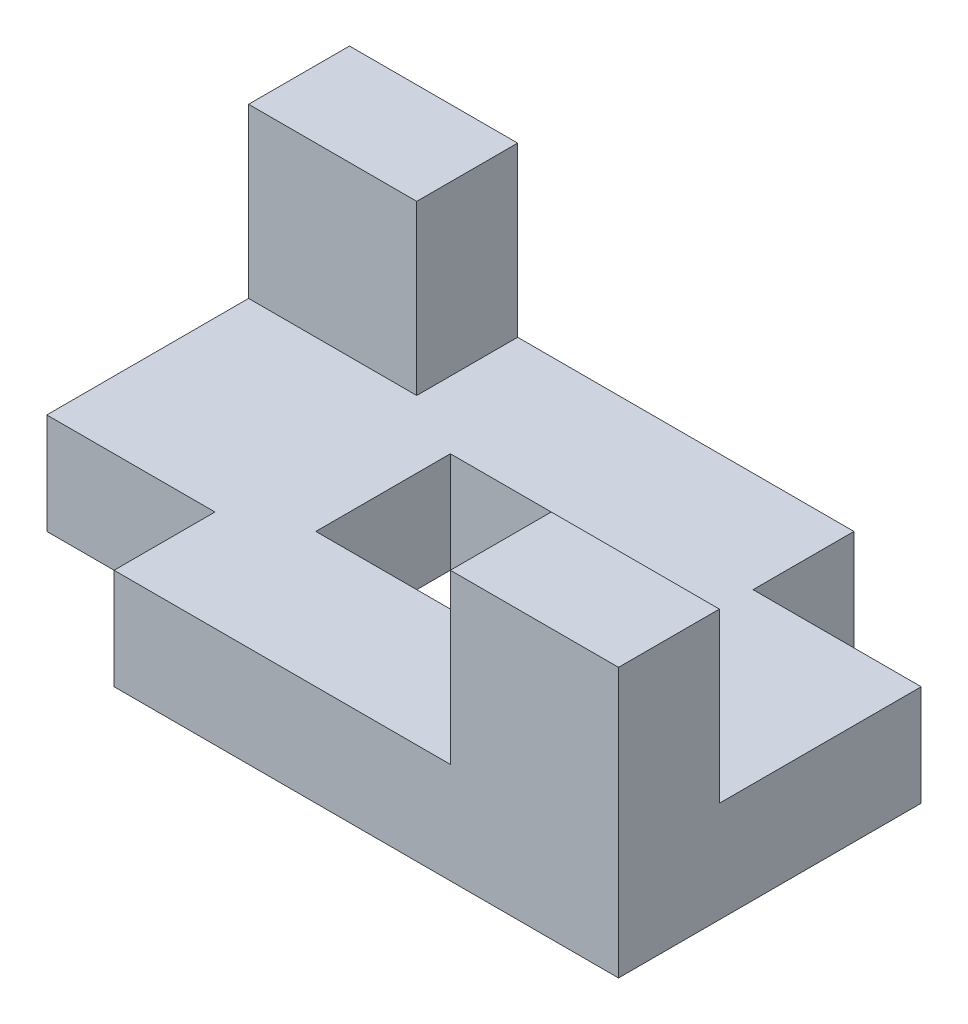
ISO-10303-21;
HEADER;
FILE_DESCRIPTION(('STEP AP214'),'2;1');
FILE_NAME('part.step','',(''),(''),'','','');
FILE_SCHEMA(('AUTOMOTIVE_DESIGN { 1 0 10303 214 1 1 1 1 }'));
ENDSEC;
DATA;
#1=APPLICATION_CONTEXT('core data for automotive mechanical design processes');
#2=APPLICATION_PROTOCOL_DEFINITION('international standard','automotive_design',2000,#1);
#3=PRODUCT_CONTEXT('',#1,'mechanical');
#4=PRODUCT('Part','Part','',(#3));
#5=PRODUCT_RELATED_PRODUCT_CATEGORY('part','',(#4));
#6=PRODUCT_DEFINITION_FORMATION('','',#4);
#7=PRODUCT_DEFINITION_CONTEXT('part definition',#1,'design');
#8=PRODUCT_DEFINITION('design','',#6,#7);
#9=PRODUCT_DEFINITION_SHAPE('','',#8);
#10=(LENGTH_UNIT() NAMED_UNIT(*) SI_UNIT(.MILLI.,.METRE.));
#11=(NAMED_UNIT(*) PLANE_ANGLE_UNIT() SI_UNIT($,.RADIAN.));
#12=(NAMED_UNIT(*) SI_UNIT($,.STERADIAN.) SOLID_ANGLE_UNIT());
#13=UNCERTAINTY_MEASURE_WITH_UNIT(LENGTH_MEASURE(1.E-05),#10,'distance_accuracy_value','');
#14=(GEOMETRIC_REPRESENTATION_CONTEXT(3) GLOBAL_UNCERTAINTY_ASSIGNED_CONTEXT((#13)) GLOBAL_UNIT_ASSIGNED_CONTEXT((#10,
#11,#12)) REPRESENTATION_CONTEXT('',''));
#15=CARTESIAN_POINT('',(0.,0.,0.));
#16=DIRECTION('',(0.,0.,1.));
#17=DIRECTION('',(1.,0.,0.));
#18=AXIS2_PLACEMENT_3D('',#15,#16,#17);
#19=CARTESIAN_POINT('',(0.,15.,0.));
#20=DIRECTION('',(0.,1.,0.));
#21=DIRECTION('',(0.,0.,1.));
#22=AXIS2_PLACEMENT_3D('',#19,#20,#21);
#23=PLANE('',#22);
#24=DIRECTION('',(0.,0.,-1.));
#25=VECTOR('',#24,1.);
#26=CARTESIAN_POINT('',(15.,15.,-10.));
#27=LINE('',#26,#25);
#28=CARTESIAN_POINT('',(15.,15.,10.));
#29=VERTEX_POINT('',#28);
#30=CARTESIAN_POINT('',(15.,15.,-10.));
#31=VERTEX_POINT('',#30);
#32=EDGE_CURVE('E55',#29,#31,#27,.T.);
#33=ORIENTED_EDGE('',*,*,#32,.F.);
#34=DIRECTION('',(1.,0.,0.));
#35=VECTOR('',#34,1.);
#36=CARTESIAN_POINT('',(-15.,15.,10.));
#37=LINE('',#36,#35);
#38=CARTESIAN_POINT('',(-15.,15.,10.));
#39=VERTEX_POINT('',#38);
#40=EDGE_CURVE('E185',#39,#29,#37,.T.);
#41=ORIENTED_EDGE('',*,*,#40,.F.);
#42=DIRECTION('',(0.,0.,1.));
#43=VECTOR('',#42,1.);
#44=CARTESIAN_POINT('',(-15.,15.,-10.));
#45=LINE('',#44,#43);
#46=CARTESIAN_POINT('',(-15.,15.,-10.));
#47=VERTEX_POINT('',#46);
#48=EDGE_CURVE('E168',#47,#39,#45,.T.);
#49=ORIENTED_EDGE('',*,*,#48,.F.);
#50=DIRECTION('',(-1.,0.,0.));
#51=VECTOR('',#50,1.);
#52=CARTESIAN_POINT('',(-15.,15.,-10.));
#53=LINE('',#52,#51);
#54=EDGE_CURVE('E178',#31,#47,#53,.T.);
#55=ORIENTED_EDGE('',*,*,#54,.F.);
#56=EDGE_LOOP('',(#33,#41,#49,#55));
#57=FACE_BOUND('',#56,.T.);
#58=DIRECTION('',(1.,0.,0.));
#59=VECTOR('',#58,1.);
#60=CARTESIAN_POINT('',(50.,15.,-15.));
#61=LINE('',#60,#59);
#62=CARTESIAN_POINT('',(25.,15.,-15.));
#63=VERTEX_POINT('',#62);
#64=CARTESIAN_POINT('',(50.,15.,-15.));
#65=VERTEX_POINT('',#64);
#66=EDGE_CURVE('E203',#63,#65,#61,.T.);
#67=ORIENTED_EDGE('',*,*,#66,.F.);
#68=DIRECTION('',(0.,0.,1.));
#69=VECTOR('',#68,1.);
#70=CARTESIAN_POINT('',(25.,15.,-30.));
#71=LINE('',#70,#69);
#72=CARTESIAN_POINT('',(25.,15.,-30.));
#73=VERTEX_POINT('',#72);
#74=EDGE_CURVE('E195',#73,#63,#71,.T.);
#75=ORIENTED_EDGE('',*,*,#74,.F.);
#76=DIRECTION('',(-1.,0.,0.));
#77=VECTOR('',#76,1.);
#78=CARTESIAN_POINT('',(-50.,15.,-30.));
#79=LINE('',#78,#77);
#80=CARTESIAN_POINT('',(-25.,15.,-30.));
#81=VERTEX_POINT('',#80);
#82=EDGE_CURVE('E306',#73,#81,#79,.T.);
#83=ORIENTED_EDGE('',*,*,#82,.T.);
#84=DIRECTION('',(0.,0.,1.));
#85=VECTOR('',#84,1.);
#86=CARTESIAN_POINT('',(-25.,15.,-30.));
#87=LINE('',#86,#85);
#88=CARTESIAN_POINT('',(-25.,15.,-15.));
#89=VERTEX_POINT('',#88);
#90=EDGE_CURVE('E273',#81,#89,#87,.T.);
#91=ORIENTED_EDGE('',*,*,#90,.T.);
#92=DIRECTION('',(1.,0.,0.));
#93=VECTOR('',#92,1.);
#94=CARTESIAN_POINT('',(-50.,15.,-15.));
#95=LINE('',#94,#93);
#96=CARTESIAN_POINT('',(-50.,15.,-15.));
#97=VERTEX_POINT('',#96);
#98=EDGE_CURVE('E267',#97,#89,#95,.T.);
#99=ORIENTED_EDGE('',*,*,#98,.F.);
#100=DIRECTION('',(0.,0.,1.));
#101=VECTOR('',#100,1.);
#102=CARTESIAN_POINT('',(-50.,15.,-30.));
#103=LINE('',#102,#101);
#104=CARTESIAN_POINT('',(-50.,15.,15.));
#105=VERTEX_POINT('',#104);
#106=EDGE_CURVE('E310',#97,#105,#103,.T.);
#107=ORIENTED_EDGE('',*,*,#106,.T.);
#108=DIRECTION('',(-1.,0.,0.));
#109=VECTOR('',#108,1.);
#110=CARTESIAN_POINT('',(-50.,15.,15.));
#111=LINE('',#110,#109);
#112=CARTESIAN_POINT('',(-25.,15.,15.));
#113=VERTEX_POINT('',#112);
#114=EDGE_CURVE('E220',#113,#105,#111,.T.);
#115=ORIENTED_EDGE('',*,*,#114,.F.);
#116=DIRECTION('',(0.,0.,-1.));
#117=VECTOR('',#116,1.);
#118=CARTESIAN_POINT('',(-25.,15.,30.));
#119=LINE('',#118,#117);
#120=CARTESIAN_POINT('',(-25.,15.,30.));
#121=VERTEX_POINT('',#120);
#122=EDGE_CURVE('E211',#121,#113,#119,.T.);
#123=ORIENTED_EDGE('',*,*,#122,.F.);
#124=DIRECTION('',(1.,0.,0.));
#125=VECTOR('',#124,1.);
#126=CARTESIAN_POINT('',(-50.,15.,30.));
#127=LINE('',#126,#125);
#128=CARTESIAN_POINT('',(25.,15.,30.));
#129=VERTEX_POINT('',#128);
#130=EDGE_CURVE('E314',#121,#129,#127,.T.);
#131=ORIENTED_EDGE('',*,*,#130,.T.);
#132=DIRECTION('',(0.,0.,1.));
#133=VECTOR('',#132,1.);
#134=CARTESIAN_POINT('',(25.,15.,30.));
#135=LINE('',#134,#133);
#136=CARTESIAN_POINT('',(25.,15.,15.));
#137=VERTEX_POINT('',#136);
#138=EDGE_CURVE('E239',#137,#129,#135,.T.);
#139=ORIENTED_EDGE('',*,*,#138,.F.);
#140=DIRECTION('',(-1.,0.,0.));
#141=VECTOR('',#140,1.);
#142=CARTESIAN_POINT('',(50.,15.,15.));
#143=LINE('',#142,#141);
#144=CARTESIAN_POINT('',(50.,15.,15.));
#145=VERTEX_POINT('',#144);
#146=EDGE_CURVE('E228',#145,#137,#143,.T.);
#147=ORIENTED_EDGE('',*,*,#146,.F.);
#148=DIRECTION('',(0.,0.,-1.));
#149=VECTOR('',#148,1.);
#150=CARTESIAN_POINT('',(50.,15.,-30.));
#151=LINE('',#150,#149);
#152=EDGE_CURVE('E302',#145,#65,#151,.T.);
#153=ORIENTED_EDGE('',*,*,#152,.T.);
#154=EDGE_LOOP('',(#67,#75,#83,#91,#99,#107,#115,#123,#131,#139,#147,#153));
#155=FACE_BOUND('',#154,.T.);
#156=ADVANCED_FACE('F39',(#57,#155),#23,.T.);
#157=CARTESIAN_POINT('',(50.,15.,-30.));
#158=DIRECTION('',(-1.,0.,0.));
#159=DIRECTION('',(0.,0.,1.));
#160=AXIS2_PLACEMENT_3D('',#157,#158,#159);
#161=PLANE('',#160);
#162=DIRECTION('',(0.,0.,-1.));
#163=VECTOR('',#162,1.);
#164=CARTESIAN_POINT('',(50.,0.,-30.));
#165=LINE('',#164,#163);
#166=CARTESIAN_POINT('',(50.,0.,30.));
#167=VERTEX_POINT('',#166);
#168=CARTESIAN_POINT('',(50.,0.,-15.));
#169=VERTEX_POINT('',#168);
#170=EDGE_CURVE('E301',#167,#169,#165,.T.);
#171=ORIENTED_EDGE('',*,*,#170,.T.);
#172=DIRECTION('',(0.,1.,0.));
#173=VECTOR('',#172,1.);
#174=CARTESIAN_POINT('',(50.,-10.,-15.));
#175=LINE('',#174,#173);
#176=EDGE_CURVE('E207',#169,#65,#175,.T.);
#177=ORIENTED_EDGE('',*,*,#176,.T.);
#178=ORIENTED_EDGE('',*,*,#152,.F.);
#179=DIRECTION('',(0.,-1.,0.));
#180=VECTOR('',#179,1.);
#181=CARTESIAN_POINT('',(50.,40.,15.));
#182=LINE('',#181,#180);
#183=CARTESIAN_POINT('',(50.,40.,15.));
#184=VERTEX_POINT('',#183);
#185=EDGE_CURVE('E263',#184,#145,#182,.T.);
#186=ORIENTED_EDGE('',*,*,#185,.F.);
#187=DIRECTION('',(0.,0.,-1.));
#188=VECTOR('',#187,1.);
#189=CARTESIAN_POINT('',(50.,40.,30.));
#190=LINE('',#189,#188);
#191=CARTESIAN_POINT('',(50.,40.,30.));
#192=VERTEX_POINT('',#191);
#193=EDGE_CURVE('E234',#192,#184,#190,.T.);
#194=ORIENTED_EDGE('',*,*,#193,.F.);
#195=DIRECTION('',(0.,-1.,0.));
#196=VECTOR('',#195,1.);
#197=CARTESIAN_POINT('',(50.,15.,30.));
#198=LINE('',#197,#196);
#199=EDGE_CURVE('E317',#192,#167,#198,.T.);
#200=ORIENTED_EDGE('',*,*,#199,.T.);
#201=EDGE_LOOP('',(#171,#177,#178,#186,#194,#200));
#202=FACE_BOUND('',#201,.T.);
#203=ADVANCED_FACE('F41',(#202),#161,.F.);
#204=CARTESIAN_POINT('',(-50.,15.,-30.));
#205=DIRECTION('',(0.,0.,1.));
#206=DIRECTION('',(1.,0.,0.));
#207=AXIS2_PLACEMENT_3D('',#204,#205,#206);
#208=PLANE('',#207);
#209=ORIENTED_EDGE('',*,*,#82,.F.);
#210=DIRECTION('',(0.,1.,0.));
#211=VECTOR('',#210,1.);
#212=CARTESIAN_POINT('',(25.,-10.,-30.));
#213=LINE('',#212,#211);
#214=CARTESIAN_POINT('',(25.,0.,-30.));
#215=VERTEX_POINT('',#214);
#216=EDGE_CURVE('E206',#215,#73,#213,.T.);
#217=ORIENTED_EDGE('',*,*,#216,.F.);
#218=DIRECTION('',(-1.,0.,0.));
#219=VECTOR('',#218,1.);
#220=CARTESIAN_POINT('',(-50.,0.,-30.));
#221=LINE('',#220,#219);
#222=CARTESIAN_POINT('',(-50.,0.,-30.));
#223=VERTEX_POINT('',#222);
#224=EDGE_CURVE('E321',#215,#223,#221,.T.);
#225=ORIENTED_EDGE('',*,*,#224,.T.);
#226=DIRECTION('',(0.,-1.,0.));
#227=VECTOR('',#226,1.);
#228=CARTESIAN_POINT('',(-50.,15.,-30.));
#229=LINE('',#228,#227);
#230=CARTESIAN_POINT('',(-50.,40.,-30.));
#231=VERTEX_POINT('',#230);
#232=EDGE_CURVE('E333',#231,#223,#229,.T.);
#233=ORIENTED_EDGE('',*,*,#232,.F.);
#234=DIRECTION('',(1.,0.,0.));
#235=VECTOR('',#234,1.);
#236=CARTESIAN_POINT('',(-50.,40.,-30.));
#237=LINE('',#236,#235);
#238=CARTESIAN_POINT('',(-25.,40.,-30.));
#239=VERTEX_POINT('',#238);
#240=EDGE_CURVE('E280',#231,#239,#237,.T.);
#241=ORIENTED_EDGE('',*,*,#240,.T.);
#242=DIRECTION('',(0.,-1.,0.));
#243=VECTOR('',#242,1.);
#244=CARTESIAN_POINT('',(-25.,40.,-30.));
#245=LINE('',#244,#243);
#246=EDGE_CURVE('E284',#239,#81,#245,.T.);
#247=ORIENTED_EDGE('',*,*,#246,.T.);
#248=EDGE_LOOP('',(#209,#217,#225,#233,#241,#247));
#249=FACE_BOUND('',#248,.T.);
#250=ADVANCED_FACE('F384',(#249),#208,.F.);
#251=CARTESIAN_POINT('',(-50.,15.,-30.));
#252=DIRECTION('',(1.,0.,0.));
#253=DIRECTION('',(0.,0.,-1.));
#254=AXIS2_PLACEMENT_3D('',#251,#252,#253);
#255=PLANE('',#254);
#256=DIRECTION('',(0.,0.,1.));
#257=VECTOR('',#256,1.);
#258=CARTESIAN_POINT('',(-50.,0.,-30.));
#259=LINE('',#258,#257);
#260=CARTESIAN_POINT('',(-50.,0.,15.));
#261=VERTEX_POINT('',#260);
#262=EDGE_CURVE('E324',#223,#261,#259,.T.);
#263=ORIENTED_EDGE('',*,*,#262,.T.);
#264=DIRECTION('',(0.,1.,0.));
#265=VECTOR('',#264,1.);
#266=CARTESIAN_POINT('',(-50.,-10.,15.));
#267=LINE('',#266,#265);
#268=EDGE_CURVE('E224',#261,#105,#267,.T.);
#269=ORIENTED_EDGE('',*,*,#268,.T.);
#270=ORIENTED_EDGE('',*,*,#106,.F.);
#271=DIRECTION('',(0.,-1.,0.));
#272=VECTOR('',#271,1.);
#273=CARTESIAN_POINT('',(-50.,40.,-15.));
#274=LINE('',#273,#272);
#275=CARTESIAN_POINT('',(-50.,40.,-15.));
#276=VERTEX_POINT('',#275);
#277=EDGE_CURVE('E297',#276,#97,#274,.T.);
#278=ORIENTED_EDGE('',*,*,#277,.F.);
#279=DIRECTION('',(0.,0.,1.));
#280=VECTOR('',#279,1.);
#281=CARTESIAN_POINT('',(-50.,40.,-30.));
#282=LINE('',#281,#280);
#283=EDGE_CURVE('E268',#231,#276,#282,.T.);
#284=ORIENTED_EDGE('',*,*,#283,.F.);
#285=ORIENTED_EDGE('',*,*,#232,.T.);
#286=EDGE_LOOP('',(#263,#269,#270,#278,#284,#285));
#287=FACE_BOUND('',#286,.T.);
#288=ADVANCED_FACE('F395',(#287),#255,.F.);
#289=CARTESIAN_POINT('',(-50.,15.,30.));
#290=DIRECTION('',(0.,0.,-1.));
#291=DIRECTION('',(-1.,0.,0.));
#292=AXIS2_PLACEMENT_3D('',#289,#290,#291);
#293=PLANE('',#292);
#294=ORIENTED_EDGE('',*,*,#130,.F.);
#295=DIRECTION('',(0.,1.,0.));
#296=VECTOR('',#295,1.);
#297=CARTESIAN_POINT('',(-25.,-10.,30.));
#298=LINE('',#297,#296);
#299=CARTESIAN_POINT('',(-25.,0.,30.));
#300=VERTEX_POINT('',#299);
#301=EDGE_CURVE('E223',#300,#121,#298,.T.);
#302=ORIENTED_EDGE('',*,*,#301,.F.);
#303=DIRECTION('',(1.,0.,0.));
#304=VECTOR('',#303,1.);
#305=CARTESIAN_POINT('',(-50.,0.,30.));
#306=LINE('',#305,#304);
#307=EDGE_CURVE('E307',#300,#167,#306,.T.);
#308=ORIENTED_EDGE('',*,*,#307,.T.);
#309=ORIENTED_EDGE('',*,*,#199,.F.);
#310=DIRECTION('',(1.,0.,0.));
#311=VECTOR('',#310,1.);
#312=CARTESIAN_POINT('',(50.,40.,30.));
#313=LINE('',#312,#311);
#314=CARTESIAN_POINT('',(25.,40.,30.));
#315=VERTEX_POINT('',#314);
#316=EDGE_CURVE('E245',#315,#192,#313,.T.);
#317=ORIENTED_EDGE('',*,*,#316,.F.);
#318=DIRECTION('',(0.,-1.,0.));
#319=VECTOR('',#318,1.);
#320=CARTESIAN_POINT('',(25.,40.,30.));
#321=LINE('',#320,#319);
#322=EDGE_CURVE('E249',#315,#129,#321,.T.);
#323=ORIENTED_EDGE('',*,*,#322,.T.);
#324=EDGE_LOOP('',(#294,#302,#308,#309,#317,#323));
#325=FACE_BOUND('',#324,.T.);
#326=ADVANCED_FACE('F392',(#325),#293,.F.);
#327=CARTESIAN_POINT('',(0.,0.,0.));
#328=DIRECTION('',(0.,1.,0.));
#329=DIRECTION('',(0.,0.,1.));
#330=AXIS2_PLACEMENT_3D('',#327,#328,#329);
#331=PLANE('',#330);
#332=DIRECTION('',(1.,0.,0.));
#333=VECTOR('',#332,1.);
#334=CARTESIAN_POINT('',(0.,0.,10.));
#335=LINE('',#334,#333);
#336=CARTESIAN_POINT('',(-15.,0.,10.));
#337=VERTEX_POINT('',#336);
#338=CARTESIAN_POINT('',(15.,0.,10.));
#339=VERTEX_POINT('',#338);
#340=EDGE_CURVE('E48',#337,#339,#335,.T.);
#341=ORIENTED_EDGE('',*,*,#340,.T.);
#342=DIRECTION('',(0.,0.,-1.));
#343=VECTOR('',#342,1.);
#344=CARTESIAN_POINT('',(15.,0.,0.));
#345=LINE('',#344,#343);
#346=CARTESIAN_POINT('',(15.,0.,-10.));
#347=VERTEX_POINT('',#346);
#348=EDGE_CURVE('E11',#339,#347,#345,.T.);
#349=ORIENTED_EDGE('',*,*,#348,.T.);
#350=DIRECTION('',(-1.,0.,0.));
#351=VECTOR('',#350,1.);
#352=CARTESIAN_POINT('',(0.,0.,-10.));
#353=LINE('',#352,#351);
#354=CARTESIAN_POINT('',(-15.,0.,-10.));
#355=VERTEX_POINT('',#354);
#356=EDGE_CURVE('E353',#347,#355,#353,.T.);
#357=ORIENTED_EDGE('',*,*,#356,.T.);
#358=DIRECTION('',(0.,0.,1.));
#359=VECTOR('',#358,1.);
#360=CARTESIAN_POINT('',(-15.,0.,0.));
#361=LINE('',#360,#359);
#362=EDGE_CURVE('E171',#355,#337,#361,.T.);
#363=ORIENTED_EDGE('',*,*,#362,.T.);
#364=EDGE_LOOP('',(#341,#349,#357,#363));
#365=FACE_BOUND('',#364,.T.);
#366=DIRECTION('',(0.,0.,1.));
#367=VECTOR('',#366,1.);
#368=CARTESIAN_POINT('',(25.,0.,0.));
#369=LINE('',#368,#367);
#370=CARTESIAN_POINT('',(25.,0.,-15.));
#371=VERTEX_POINT('',#370);
#372=EDGE_CURVE('E345',#215,#371,#369,.T.);
#373=ORIENTED_EDGE('',*,*,#372,.T.);
#374=DIRECTION('',(1.,0.,0.));
#375=VECTOR('',#374,1.);
#376=CARTESIAN_POINT('',(0.,0.,-15.));
#377=LINE('',#376,#375);
#378=EDGE_CURVE('E349',#371,#169,#377,.T.);
#379=ORIENTED_EDGE('',*,*,#378,.T.);
#380=ORIENTED_EDGE('',*,*,#170,.F.);
#381=ORIENTED_EDGE('',*,*,#307,.F.);
#382=DIRECTION('',(0.,0.,-1.));
#383=VECTOR('',#382,1.);
#384=CARTESIAN_POINT('',(-25.,0.,0.));
#385=LINE('',#384,#383);
#386=CARTESIAN_POINT('',(-25.,0.,15.));
#387=VERTEX_POINT('',#386);
#388=EDGE_CURVE('E337',#300,#387,#385,.T.);
#389=ORIENTED_EDGE('',*,*,#388,.T.);
#390=DIRECTION('',(-1.,0.,0.));
#391=VECTOR('',#390,1.);
#392=CARTESIAN_POINT('',(0.,0.,15.));
#393=LINE('',#392,#391);
#394=EDGE_CURVE('E341',#387,#261,#393,.T.);
#395=ORIENTED_EDGE('',*,*,#394,.T.);
#396=ORIENTED_EDGE('',*,*,#262,.F.);
#397=ORIENTED_EDGE('',*,*,#224,.F.);
#398=EDGE_LOOP('',(#373,#379,#380,#381,#389,#395,#396,#397));
#399=FACE_BOUND('',#398,.T.);
#400=ADVANCED_FACE('F360',(#365,#399),#331,.F.);
#401=CARTESIAN_POINT('',(-50.,40.,-15.));
#402=DIRECTION('',(0.,0.,-1.));
#403=DIRECTION('',(-1.,0.,0.));
#404=AXIS2_PLACEMENT_3D('',#401,#402,#403);
#405=PLANE('',#404);
#406=ORIENTED_EDGE('',*,*,#98,.T.);
#407=DIRECTION('',(0.,-1.,0.));
#408=VECTOR('',#407,1.);
#409=CARTESIAN_POINT('',(-25.,40.,-15.));
#410=LINE('',#409,#408);
#411=CARTESIAN_POINT('',(-25.,40.,-15.));
#412=VERTEX_POINT('',#411);
#413=EDGE_CURVE('E293',#412,#89,#410,.T.);
#414=ORIENTED_EDGE('',*,*,#413,.F.);
#415=DIRECTION('',(1.,0.,0.));
#416=VECTOR('',#415,1.);
#417=CARTESIAN_POINT('',(-50.,40.,-15.));
#418=LINE('',#417,#416);
#419=EDGE_CURVE('E272',#276,#412,#418,.T.);
#420=ORIENTED_EDGE('',*,*,#419,.F.);
#421=ORIENTED_EDGE('',*,*,#277,.T.);
#422=EDGE_LOOP('',(#406,#414,#420,#421));
#423=FACE_BOUND('',#422,.T.);
#424=ADVANCED_FACE('F388',(#423),#405,.F.);
#425=CARTESIAN_POINT('',(-25.,40.,-30.));
#426=DIRECTION('',(1.,0.,0.));
#427=DIRECTION('',(0.,0.,-1.));
#428=AXIS2_PLACEMENT_3D('',#425,#426,#427);
#429=PLANE('',#428);
#430=ORIENTED_EDGE('',*,*,#90,.F.);
#431=ORIENTED_EDGE('',*,*,#246,.F.);
#432=DIRECTION('',(0.,0.,1.));
#433=VECTOR('',#432,1.);
#434=CARTESIAN_POINT('',(-25.,40.,-30.));
#435=LINE('',#434,#433);
#436=EDGE_CURVE('E276',#239,#412,#435,.T.);
#437=ORIENTED_EDGE('',*,*,#436,.T.);
#438=ORIENTED_EDGE('',*,*,#413,.T.);
#439=EDGE_LOOP('',(#430,#431,#437,#438));
#440=FACE_BOUND('',#439,.T.);
#441=ADVANCED_FACE('F421',(#440),#429,.T.);
#442=CARTESIAN_POINT('',(0.,40.,0.));
#443=DIRECTION('',(0.,1.,0.));
#444=DIRECTION('',(0.,0.,1.));
#445=AXIS2_PLACEMENT_3D('',#442,#443,#444);
#446=PLANE('',#445);
#447=ORIENTED_EDGE('',*,*,#283,.T.);
#448=ORIENTED_EDGE('',*,*,#419,.T.);
#449=ORIENTED_EDGE('',*,*,#436,.F.);
#450=ORIENTED_EDGE('',*,*,#240,.F.);
#451=EDGE_LOOP('',(#447,#448,#449,#450));
#452=FACE_BOUND('',#451,.T.);
#453=ADVANCED_FACE('F418',(#452),#446,.T.);
#454=CARTESIAN_POINT('',(50.,40.,15.));
#455=DIRECTION('',(0.,0.,1.));
#456=DIRECTION('',(1.,0.,0.));
#457=AXIS2_PLACEMENT_3D('',#454,#455,#456);
#458=PLANE('',#457);
#459=ORIENTED_EDGE('',*,*,#146,.T.);
#460=DIRECTION('',(0.,-1.,0.));
#461=VECTOR('',#460,1.);
#462=CARTESIAN_POINT('',(25.,40.,15.));
#463=LINE('',#462,#461);
#464=CARTESIAN_POINT('',(25.,40.,15.));
#465=VERTEX_POINT('',#464);
#466=EDGE_CURVE('E259',#465,#137,#463,.T.);
#467=ORIENTED_EDGE('',*,*,#466,.F.);
#468=DIRECTION('',(-1.,0.,0.));
#469=VECTOR('',#468,1.);
#470=CARTESIAN_POINT('',(50.,40.,15.));
#471=LINE('',#470,#469);
#472=EDGE_CURVE('E238',#184,#465,#471,.T.);
#473=ORIENTED_EDGE('',*,*,#472,.F.);
#474=ORIENTED_EDGE('',*,*,#185,.T.);
#475=EDGE_LOOP('',(#459,#467,#473,#474));
#476=FACE_BOUND('',#475,.T.);
#477=ADVANCED_FACE('F440',(#476),#458,.F.);
#478=CARTESIAN_POINT('',(25.,40.,30.));
#479=DIRECTION('',(1.,0.,0.));
#480=DIRECTION('',(0.,0.,-1.));
#481=AXIS2_PLACEMENT_3D('',#478,#479,#480);
#482=PLANE('',#481);
#483=ORIENTED_EDGE('',*,*,#138,.T.);
#484=ORIENTED_EDGE('',*,*,#322,.F.);
#485=DIRECTION('',(0.,0.,1.));
#486=VECTOR('',#485,1.);
#487=CARTESIAN_POINT('',(25.,40.,30.));
#488=LINE('',#487,#486);
#489=EDGE_CURVE('E242',#465,#315,#488,.T.);
#490=ORIENTED_EDGE('',*,*,#489,.F.);
#491=ORIENTED_EDGE('',*,*,#466,.T.);
#492=EDGE_LOOP('',(#483,#484,#490,#491));
#493=FACE_BOUND('',#492,.T.);
#494=ADVANCED_FACE('F436',(#493),#482,.F.);
#495=CARTESIAN_POINT('',(0.,40.,0.));
#496=DIRECTION('',(0.,1.,0.));
#497=DIRECTION('',(0.,0.,1.));
#498=AXIS2_PLACEMENT_3D('',#495,#496,#497);
#499=PLANE('',#498);
#500=ORIENTED_EDGE('',*,*,#193,.T.);
#501=ORIENTED_EDGE('',*,*,#472,.T.);
#502=ORIENTED_EDGE('',*,*,#489,.T.);
#503=ORIENTED_EDGE('',*,*,#316,.T.);
#504=EDGE_LOOP('',(#500,#501,#502,#503));
#505=FACE_BOUND('',#504,.T.);
#506=ADVANCED_FACE('F452',(#505),#499,.T.);
#507=CARTESIAN_POINT('',(-50.,-10.,15.));
#508=DIRECTION('',(0.,0.,-1.));
#509=DIRECTION('',(-1.,0.,0.));
#510=AXIS2_PLACEMENT_3D('',#507,#508,#509);
#511=PLANE('',#510);
#512=DIRECTION('',(0.,1.,0.));
#513=VECTOR('',#512,1.);
#514=CARTESIAN_POINT('',(-25.,-10.,15.));
#515=LINE('',#514,#513);
#516=EDGE_CURVE('E229',#387,#113,#515,.T.);
#517=ORIENTED_EDGE('',*,*,#516,.T.);
#518=ORIENTED_EDGE('',*,*,#114,.T.);
#519=ORIENTED_EDGE('',*,*,#268,.F.);
#520=ORIENTED_EDGE('',*,*,#394,.F.);
#521=EDGE_LOOP('',(#517,#518,#519,#520));
#522=FACE_BOUND('',#521,.T.);
#523=ADVANCED_FACE('F426',(#522),#511,.F.);
#524=CARTESIAN_POINT('',(-25.,-10.,30.));
#525=DIRECTION('',(1.,0.,0.));
#526=DIRECTION('',(0.,0.,-1.));
#527=AXIS2_PLACEMENT_3D('',#524,#525,#526);
#528=PLANE('',#527);
#529=ORIENTED_EDGE('',*,*,#301,.T.);
#530=ORIENTED_EDGE('',*,*,#122,.T.);
#531=ORIENTED_EDGE('',*,*,#516,.F.);
#532=ORIENTED_EDGE('',*,*,#388,.F.);
#533=EDGE_LOOP('',(#529,#530,#531,#532));
#534=FACE_BOUND('',#533,.T.);
#535=ADVANCED_FACE('F430',(#534),#528,.F.);
#536=CARTESIAN_POINT('',(50.,-10.,-15.));
#537=DIRECTION('',(0.,0.,1.));
#538=DIRECTION('',(1.,0.,0.));
#539=AXIS2_PLACEMENT_3D('',#536,#537,#538);
#540=PLANE('',#539);
#541=DIRECTION('',(0.,1.,0.));
#542=VECTOR('',#541,1.);
#543=CARTESIAN_POINT('',(25.,-10.,-15.));
#544=LINE('',#543,#542);
#545=EDGE_CURVE('E212',#371,#63,#544,.T.);
#546=ORIENTED_EDGE('',*,*,#545,.T.);
#547=ORIENTED_EDGE('',*,*,#66,.T.);
#548=ORIENTED_EDGE('',*,*,#176,.F.);
#549=ORIENTED_EDGE('',*,*,#378,.F.);
#550=EDGE_LOOP('',(#546,#547,#548,#549));
#551=FACE_BOUND('',#550,.T.);
#552=ADVANCED_FACE('F374',(#551),#540,.F.);
#553=CARTESIAN_POINT('',(25.,-10.,-30.));
#554=DIRECTION('',(-1.,0.,0.));
#555=DIRECTION('',(0.,0.,1.));
#556=AXIS2_PLACEMENT_3D('',#553,#554,#555);
#557=PLANE('',#556);
#558=ORIENTED_EDGE('',*,*,#216,.T.);
#559=ORIENTED_EDGE('',*,*,#74,.T.);
#560=ORIENTED_EDGE('',*,*,#545,.F.);
#561=ORIENTED_EDGE('',*,*,#372,.F.);
#562=EDGE_LOOP('',(#558,#559,#560,#561));
#563=FACE_BOUND('',#562,.T.);
#564=ADVANCED_FACE('F367',(#563),#557,.F.);
#565=CARTESIAN_POINT('',(15.,-10.,-10.));
#566=DIRECTION('',(1.,0.,0.));
#567=DIRECTION('',(0.,0.,-1.));
#568=AXIS2_PLACEMENT_3D('',#565,#566,#567);
#569=PLANE('',#568);
#570=DIRECTION('',(0.,1.,0.));
#571=VECTOR('',#570,1.);
#572=CARTESIAN_POINT('',(15.,-10.,10.));
#573=LINE('',#572,#571);
#574=EDGE_CURVE('E192',#339,#29,#573,.T.);
#575=ORIENTED_EDGE('',*,*,#574,.T.);
#576=ORIENTED_EDGE('',*,*,#32,.T.);
#577=DIRECTION('',(0.,1.,0.));
#578=VECTOR('',#577,1.);
#579=CARTESIAN_POINT('',(15.,-10.,-10.));
#580=LINE('',#579,#578);
#581=EDGE_CURVE('E175',#347,#31,#580,.T.);
#582=ORIENTED_EDGE('',*,*,#581,.F.);
#583=ORIENTED_EDGE('',*,*,#348,.F.);
#584=EDGE_LOOP('',(#575,#576,#582,#583));
#585=FACE_BOUND('',#584,.T.);
#586=ADVANCED_FACE('F365',(#585),#569,.F.);
#587=CARTESIAN_POINT('',(-15.,-10.,10.));
#588=DIRECTION('',(0.,0.,1.));
#589=DIRECTION('',(1.,0.,0.));
#590=AXIS2_PLACEMENT_3D('',#587,#588,#589);
#591=PLANE('',#590);
#592=DIRECTION('',(0.,1.,0.));
#593=VECTOR('',#592,1.);
#594=CARTESIAN_POINT('',(-15.,-10.,10.));
#595=LINE('',#594,#593);
#596=EDGE_CURVE('E174',#337,#39,#595,.T.);
#597=ORIENTED_EDGE('',*,*,#596,.T.);
#598=ORIENTED_EDGE('',*,*,#40,.T.);
#599=ORIENTED_EDGE('',*,*,#574,.F.);
#600=ORIENTED_EDGE('',*,*,#340,.F.);
#601=EDGE_LOOP('',(#597,#598,#599,#600));
#602=FACE_BOUND('',#601,.T.);
#603=ADVANCED_FACE('F364',(#602),#591,.F.);
#604=CARTESIAN_POINT('',(-15.,-10.,-10.));
#605=DIRECTION('',(-1.,0.,0.));
#606=DIRECTION('',(0.,0.,1.));
#607=AXIS2_PLACEMENT_3D('',#604,#605,#606);
#608=PLANE('',#607);
#609=DIRECTION('',(0.,1.,0.));
#610=VECTOR('',#609,1.);
#611=CARTESIAN_POINT('',(-15.,-10.,-10.));
#612=LINE('',#611,#610);
#613=EDGE_CURVE('E63',#355,#47,#612,.T.);
#614=ORIENTED_EDGE('',*,*,#613,.T.);
#615=ORIENTED_EDGE('',*,*,#48,.T.);
#616=ORIENTED_EDGE('',*,*,#596,.F.);
#617=ORIENTED_EDGE('',*,*,#362,.F.);
#618=EDGE_LOOP('',(#614,#615,#616,#617));
#619=FACE_BOUND('',#618,.T.);
#620=ADVANCED_FACE('F165',(#619),#608,.F.);
#621=CARTESIAN_POINT('',(-15.,-10.,-10.));
#622=DIRECTION('',(0.,0.,-1.));
#623=DIRECTION('',(-1.,0.,0.));
#624=AXIS2_PLACEMENT_3D('',#621,#622,#623);
#625=PLANE('',#624);
#626=ORIENTED_EDGE('',*,*,#581,.T.);
#627=ORIENTED_EDGE('',*,*,#54,.T.);
#628=ORIENTED_EDGE('',*,*,#613,.F.);
#629=ORIENTED_EDGE('',*,*,#356,.F.);
#630=EDGE_LOOP('',(#626,#627,#628,#629));
#631=FACE_BOUND('',#630,.T.);
#632=ADVANCED_FACE('F179',(#631),#625,.F.);
#633=CLOSED_SHELL('',(#156,#203,#250,#288,#326,#400,#424,#441,#453,#477,#494,#506,#523,#535,
#552,#564,#586,#603,#620,#632));
#634=MANIFOLD_SOLID_BREP('B2',#633);
#635=ADVANCED_BREP_SHAPE_REPRESENTATION('',(#18,#634),#14);
#636=SHAPE_DEFINITION_REPRESENTATION(#9,#635);
ENDSEC;
END-ISO-10303-21;
